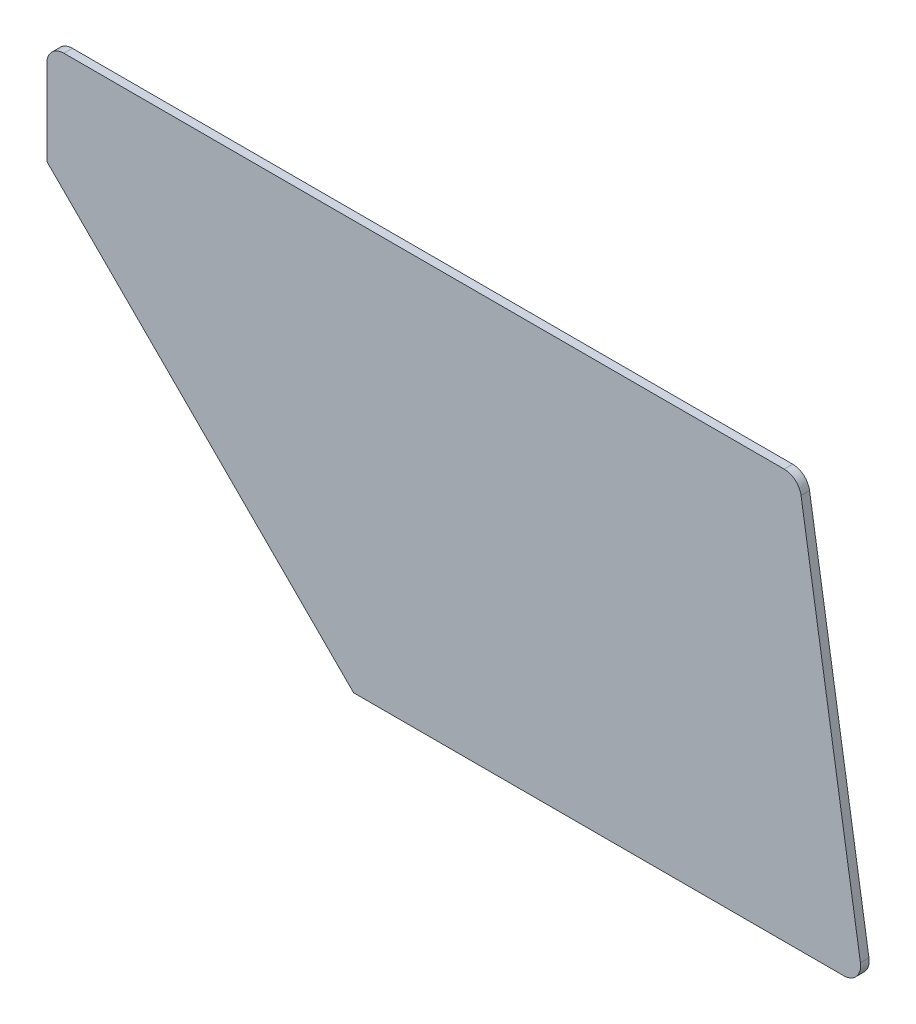
ISO-10303-21;
HEADER;
FILE_DESCRIPTION(('STEP AP214'),'2;1');
FILE_NAME('part.step','',(''),(''),'','','');
FILE_SCHEMA(('AUTOMOTIVE_DESIGN { 1 0 10303 214 1 1 1 1 }'));
ENDSEC;
DATA;
#1=APPLICATION_CONTEXT('core data for automotive mechanical design processes');
#2=APPLICATION_PROTOCOL_DEFINITION('international standard','automotive_design',2000,#1);
#3=PRODUCT_CONTEXT('',#1,'mechanical');
#4=PRODUCT('Part','Part','',(#3));
#5=PRODUCT_RELATED_PRODUCT_CATEGORY('part','',(#4));
#6=PRODUCT_DEFINITION_FORMATION('','',#4);
#7=PRODUCT_DEFINITION_CONTEXT('part definition',#1,'design');
#8=PRODUCT_DEFINITION('design','',#6,#7);
#9=PRODUCT_DEFINITION_SHAPE('','',#8);
#10=(LENGTH_UNIT() NAMED_UNIT(*) SI_UNIT(.MILLI.,.METRE.));
#11=(NAMED_UNIT(*) PLANE_ANGLE_UNIT() SI_UNIT($,.RADIAN.));
#12=(NAMED_UNIT(*) SI_UNIT($,.STERADIAN.) SOLID_ANGLE_UNIT());
#13=UNCERTAINTY_MEASURE_WITH_UNIT(LENGTH_MEASURE(1.E-05),#10,'distance_accuracy_value','');
#14=(GEOMETRIC_REPRESENTATION_CONTEXT(3) GLOBAL_UNCERTAINTY_ASSIGNED_CONTEXT((#13)) GLOBAL_UNIT_ASSIGNED_CONTEXT((#10,
#11,#12)) REPRESENTATION_CONTEXT('',''));
#15=CARTESIAN_POINT('',(0.,0.,0.));
#16=DIRECTION('',(0.,0.,1.));
#17=DIRECTION('',(1.,0.,0.));
#18=AXIS2_PLACEMENT_3D('',#15,#16,#17);
#19=CARTESIAN_POINT('',(0.,-38.1,3.175));
#20=DIRECTION('',(0.707106781186549,0.707106781186546,0.));
#21=DIRECTION('',(-0.707106781186546,0.707106781186549,0.));
#22=AXIS2_PLACEMENT_3D('',#19,#20,#21);
#23=PLANE('',#22);
#24=DIRECTION('',(0.707106781186546,-0.707106781186549,0.));
#25=VECTOR('',#24,1.);
#26=CARTESIAN_POINT('',(0.,-38.1,0.));
#27=LINE('',#26,#25);
#28=CARTESIAN_POINT('',(0.,-38.1,0.));
#29=VERTEX_POINT('',#28);
#30=CARTESIAN_POINT('',(114.3,-152.4,0.));
#31=VERTEX_POINT('',#30);
#32=EDGE_CURVE('E130',#29,#31,#27,.T.);
#33=ORIENTED_EDGE('',*,*,#32,.T.);
#34=DIRECTION('',(0.,0.,-1.));
#35=VECTOR('',#34,1.);
#36=CARTESIAN_POINT('',(114.3,-152.4,3.175));
#37=LINE('',#36,#35);
#38=CARTESIAN_POINT('',(114.3,-152.4,3.175));
#39=VERTEX_POINT('',#38);
#40=EDGE_CURVE('E11',#39,#31,#37,.T.);
#41=ORIENTED_EDGE('',*,*,#40,.F.);
#42=DIRECTION('',(0.707106781186546,-0.707106781186549,0.));
#43=VECTOR('',#42,1.);
#44=CARTESIAN_POINT('',(0.,-38.1,3.175));
#45=LINE('',#44,#43);
#46=CARTESIAN_POINT('',(0.,-38.1,3.175));
#47=VERTEX_POINT('',#46);
#48=EDGE_CURVE('E144',#47,#39,#45,.T.);
#49=ORIENTED_EDGE('',*,*,#48,.F.);
#50=DIRECTION('',(0.,0.,-1.));
#51=VECTOR('',#50,1.);
#52=CARTESIAN_POINT('',(0.,-38.1,3.175));
#53=LINE('',#52,#51);
#54=EDGE_CURVE('E126',#47,#29,#53,.T.);
#55=ORIENTED_EDGE('',*,*,#54,.T.);
#56=EDGE_LOOP('',(#33,#41,#49,#55));
#57=FACE_BOUND('',#56,.T.);
#58=ADVANCED_FACE('F34',(#57),#23,.F.);
#59=CARTESIAN_POINT('',(114.3,-152.4,3.175));
#60=DIRECTION('',(0.,1.,0.));
#61=DIRECTION('',(-1.,0.,0.));
#62=AXIS2_PLACEMENT_3D('',#59,#60,#61);
#63=PLANE('',#62);
#64=DIRECTION('',(1.,0.,0.));
#65=VECTOR('',#64,1.);
#66=CARTESIAN_POINT('',(114.3,-152.4,0.));
#67=LINE('',#66,#65);
#68=CARTESIAN_POINT('',(296.8625,-152.4,0.));
#69=VERTEX_POINT('',#68);
#70=EDGE_CURVE('E133',#31,#69,#67,.T.);
#71=ORIENTED_EDGE('',*,*,#70,.T.);
#72=DIRECTION('',(0.,0.,-1.));
#73=VECTOR('',#72,1.);
#74=CARTESIAN_POINT('',(296.8625,-152.4,3.175));
#75=LINE('',#74,#73);
#76=CARTESIAN_POINT('',(296.8625,-152.4,3.175));
#77=VERTEX_POINT('',#76);
#78=EDGE_CURVE('E42',#77,#69,#75,.T.);
#79=ORIENTED_EDGE('',*,*,#78,.F.);
#80=DIRECTION('',(1.,0.,0.));
#81=VECTOR('',#80,1.);
#82=CARTESIAN_POINT('',(114.3,-152.4,3.175));
#83=LINE('',#82,#81);
#84=EDGE_CURVE('E93',#39,#77,#83,.T.);
#85=ORIENTED_EDGE('',*,*,#84,.F.);
#86=ORIENTED_EDGE('',*,*,#40,.T.);
#87=EDGE_LOOP('',(#71,#79,#85,#86));
#88=FACE_BOUND('',#87,.T.);
#89=ADVANCED_FACE('F179',(#88),#63,.F.);
#90=CARTESIAN_POINT('',(296.8625,-146.05,3.175));
#91=DIRECTION('',(0.,0.,-1.));
#92=DIRECTION('',(-1.,0.,0.));
#93=AXIS2_PLACEMENT_3D('',#90,#91,#92);
#94=CYLINDRICAL_SURFACE('',#93,6.34999999999993);
#95=CARTESIAN_POINT('',(296.8625,-146.05,0.));
#96=DIRECTION('',(0.,0.,1.));
#97=DIRECTION('',(1.,0.,0.));
#98=AXIS2_PLACEMENT_3D('',#95,#96,#97);
#99=CIRCLE('',#98,6.34999999999993);
#100=CARTESIAN_POINT('',(303.134320962779,-145.056641146995,0.));
#101=VERTEX_POINT('',#100);
#102=EDGE_CURVE('E135',#69,#101,#99,.T.);
#103=ORIENTED_EDGE('',*,*,#102,.T.);
#104=DIRECTION('',(0.,0.,-1.));
#105=VECTOR('',#104,1.);
#106=CARTESIAN_POINT('',(303.134320962779,-145.056641146995,3.175));
#107=LINE('',#106,#105);
#108=CARTESIAN_POINT('',(303.134320962779,-145.056641146995,3.175));
#109=VERTEX_POINT('',#108);
#110=EDGE_CURVE('E151',#109,#101,#107,.T.);
#111=ORIENTED_EDGE('',*,*,#110,.F.);
#112=CARTESIAN_POINT('',(296.8625,-146.05,3.175));
#113=DIRECTION('',(0.,0.,1.));
#114=DIRECTION('',(1.,0.,0.));
#115=AXIS2_PLACEMENT_3D('',#112,#113,#114);
#116=CIRCLE('',#115,6.34999999999993);
#117=EDGE_CURVE('E159',#77,#109,#116,.T.);
#118=ORIENTED_EDGE('',*,*,#117,.F.);
#119=ORIENTED_EDGE('',*,*,#78,.T.);
#120=EDGE_LOOP('',(#103,#111,#118,#119));
#121=FACE_BOUND('',#120,.T.);
#122=ADVANCED_FACE('F157',(#121),#94,.T.);
#123=CARTESIAN_POINT('',(303.134320962779,-145.056641146995,3.175));
#124=DIRECTION('',(-0.987688340595137,-0.156434465040235,0.));
#125=DIRECTION('',(0.156434465040235,-0.987688340595137,0.));
#126=AXIS2_PLACEMENT_3D('',#123,#124,#125);
#127=PLANE('',#126);
#128=DIRECTION('',(-0.156434465040235,0.987688340595137,0.));
#129=VECTOR('',#128,1.);
#130=CARTESIAN_POINT('',(303.134320962779,-145.056641146995,0.));
#131=LINE('',#130,#129);
#132=CARTESIAN_POINT('',(281.008014649441,-5.35664114699449,0.));
#133=VERTEX_POINT('',#132);
#134=EDGE_CURVE('E137',#101,#133,#131,.T.);
#135=ORIENTED_EDGE('',*,*,#134,.T.);
#136=DIRECTION('',(0.,0.,-1.));
#137=VECTOR('',#136,1.);
#138=CARTESIAN_POINT('',(281.008014649441,-5.35664114699449,3.175));
#139=LINE('',#138,#137);
#140=CARTESIAN_POINT('',(281.008014649441,-5.35664114699449,3.175));
#141=VERTEX_POINT('',#140);
#142=EDGE_CURVE('E148',#141,#133,#139,.T.);
#143=ORIENTED_EDGE('',*,*,#142,.F.);
#144=DIRECTION('',(-0.156434465040235,0.987688340595137,0.));
#145=VECTOR('',#144,1.);
#146=CARTESIAN_POINT('',(303.134320962779,-145.056641146995,3.175));
#147=LINE('',#146,#145);
#148=EDGE_CURVE('E171',#109,#141,#147,.T.);
#149=ORIENTED_EDGE('',*,*,#148,.F.);
#150=ORIENTED_EDGE('',*,*,#110,.T.);
#151=EDGE_LOOP('',(#135,#143,#149,#150));
#152=FACE_BOUND('',#151,.T.);
#153=ADVANCED_FACE('F167',(#152),#127,.F.);
#154=CARTESIAN_POINT('',(274.736193686662,-6.34999999999997,3.175));
#155=DIRECTION('',(0.,0.,-1.));
#156=DIRECTION('',(-1.,0.,0.));
#157=AXIS2_PLACEMENT_3D('',#154,#155,#156);
#158=CYLINDRICAL_SURFACE('',#157,6.34999999999993);
#159=CARTESIAN_POINT('',(274.736193686662,-6.34999999999997,0.));
#160=DIRECTION('',(0.,0.,1.));
#161=DIRECTION('',(-1.,0.,0.));
#162=AXIS2_PLACEMENT_3D('',#159,#160,#161);
#163=CIRCLE('',#162,6.34999999999993);
#164=CARTESIAN_POINT('',(274.736193686662,0.,0.));
#165=VERTEX_POINT('',#164);
#166=EDGE_CURVE('E139',#133,#165,#163,.T.);
#167=ORIENTED_EDGE('',*,*,#166,.T.);
#168=DIRECTION('',(0.,0.,-1.));
#169=VECTOR('',#168,1.);
#170=CARTESIAN_POINT('',(274.736193686662,0.,3.175));
#171=LINE('',#170,#169);
#172=CARTESIAN_POINT('',(274.736193686662,0.,3.175));
#173=VERTEX_POINT('',#172);
#174=EDGE_CURVE('E121',#173,#165,#171,.T.);
#175=ORIENTED_EDGE('',*,*,#174,.F.);
#176=CARTESIAN_POINT('',(274.736193686662,-6.34999999999997,3.175));
#177=DIRECTION('',(0.,0.,1.));
#178=DIRECTION('',(-1.,0.,0.));
#179=AXIS2_PLACEMENT_3D('',#176,#177,#178);
#180=CIRCLE('',#179,6.34999999999993);
#181=EDGE_CURVE('E112',#141,#173,#180,.T.);
#182=ORIENTED_EDGE('',*,*,#181,.F.);
#183=ORIENTED_EDGE('',*,*,#142,.T.);
#184=EDGE_LOOP('',(#167,#175,#182,#183));
#185=FACE_BOUND('',#184,.T.);
#186=ADVANCED_FACE('F170',(#185),#158,.T.);
#187=CARTESIAN_POINT('',(274.736193686662,0.,3.175));
#188=DIRECTION('',(0.,-1.,0.));
#189=DIRECTION('',(1.,0.,0.));
#190=AXIS2_PLACEMENT_3D('',#187,#188,#189);
#191=PLANE('',#190);
#192=DIRECTION('',(-1.,0.,0.));
#193=VECTOR('',#192,1.);
#194=CARTESIAN_POINT('',(274.736193686662,0.,0.));
#195=LINE('',#194,#193);
#196=CARTESIAN_POINT('',(6.35000000000004,0.,0.));
#197=VERTEX_POINT('',#196);
#198=EDGE_CURVE('E120',#165,#197,#195,.T.);
#199=ORIENTED_EDGE('',*,*,#198,.T.);
#200=DIRECTION('',(0.,0.,-1.));
#201=VECTOR('',#200,1.);
#202=CARTESIAN_POINT('',(6.35000000000004,0.,3.175));
#203=LINE('',#202,#201);
#204=CARTESIAN_POINT('',(6.35000000000004,0.,3.175));
#205=VERTEX_POINT('',#204);
#206=EDGE_CURVE('E117',#205,#197,#203,.T.);
#207=ORIENTED_EDGE('',*,*,#206,.F.);
#208=DIRECTION('',(-1.,0.,0.));
#209=VECTOR('',#208,1.);
#210=CARTESIAN_POINT('',(274.736193686662,0.,3.175));
#211=LINE('',#210,#209);
#212=EDGE_CURVE('E106',#173,#205,#211,.T.);
#213=ORIENTED_EDGE('',*,*,#212,.F.);
#214=ORIENTED_EDGE('',*,*,#174,.T.);
#215=EDGE_LOOP('',(#199,#207,#213,#214));
#216=FACE_BOUND('',#215,.T.);
#217=ADVANCED_FACE('F118',(#216),#191,.F.);
#218=CARTESIAN_POINT('',(6.35,-6.35,3.175));
#219=DIRECTION('',(0.,0.,-1.));
#220=DIRECTION('',(-1.,0.,0.));
#221=AXIS2_PLACEMENT_3D('',#218,#219,#220);
#222=CYLINDRICAL_SURFACE('',#221,6.35);
#223=CARTESIAN_POINT('',(6.35,-6.35,0.));
#224=DIRECTION('',(0.,0.,1.));
#225=DIRECTION('',(1.,0.,0.));
#226=AXIS2_PLACEMENT_3D('',#223,#224,#225);
#227=CIRCLE('',#226,6.35);
#228=CARTESIAN_POINT('',(0.,-6.35000000000004,0.));
#229=VERTEX_POINT('',#228);
#230=EDGE_CURVE('E79',#197,#229,#227,.T.);
#231=ORIENTED_EDGE('',*,*,#230,.T.);
#232=DIRECTION('',(0.,0.,-1.));
#233=VECTOR('',#232,1.);
#234=CARTESIAN_POINT('',(0.,-6.35000000000004,3.175));
#235=LINE('',#234,#233);
#236=CARTESIAN_POINT('',(0.,-6.35000000000004,3.175));
#237=VERTEX_POINT('',#236);
#238=EDGE_CURVE('E122',#237,#229,#235,.T.);
#239=ORIENTED_EDGE('',*,*,#238,.F.);
#240=CARTESIAN_POINT('',(6.35,-6.35,3.175));
#241=DIRECTION('',(0.,0.,1.));
#242=DIRECTION('',(1.,0.,0.));
#243=AXIS2_PLACEMENT_3D('',#240,#241,#242);
#244=CIRCLE('',#243,6.35);
#245=EDGE_CURVE('E110',#205,#237,#244,.T.);
#246=ORIENTED_EDGE('',*,*,#245,.F.);
#247=ORIENTED_EDGE('',*,*,#206,.T.);
#248=EDGE_LOOP('',(#231,#239,#246,#247));
#249=FACE_BOUND('',#248,.T.);
#250=ADVANCED_FACE('F124',(#249),#222,.T.);
#251=CARTESIAN_POINT('',(0.,-6.35000000000004,3.175));
#252=DIRECTION('',(1.,0.,0.));
#253=DIRECTION('',(0.,0.,-1.));
#254=AXIS2_PLACEMENT_3D('',#251,#252,#253);
#255=PLANE('',#254);
#256=DIRECTION('',(0.,-1.,0.));
#257=VECTOR('',#256,1.);
#258=CARTESIAN_POINT('',(0.,-6.35000000000004,0.));
#259=LINE('',#258,#257);
#260=EDGE_CURVE('E85',#229,#29,#259,.T.);
#261=ORIENTED_EDGE('',*,*,#260,.T.);
#262=ORIENTED_EDGE('',*,*,#54,.F.);
#263=DIRECTION('',(0.,-1.,0.));
#264=VECTOR('',#263,1.);
#265=CARTESIAN_POINT('',(0.,-6.35000000000004,3.175));
#266=LINE('',#265,#264);
#267=EDGE_CURVE('E50',#237,#47,#266,.T.);
#268=ORIENTED_EDGE('',*,*,#267,.F.);
#269=ORIENTED_EDGE('',*,*,#238,.T.);
#270=EDGE_LOOP('',(#261,#262,#268,#269));
#271=FACE_BOUND('',#270,.T.);
#272=ADVANCED_FACE('F195',(#271),#255,.F.);
#273=CARTESIAN_POINT('',(296.8625,-146.05,3.175));
#274=DIRECTION('',(0.,0.,1.));
#275=DIRECTION('',(1.,0.,0.));
#276=AXIS2_PLACEMENT_3D('',#273,#274,#275);
#277=PLANE('',#276);
#278=ORIENTED_EDGE('',*,*,#48,.T.);
#279=ORIENTED_EDGE('',*,*,#84,.T.);
#280=ORIENTED_EDGE('',*,*,#117,.T.);
#281=ORIENTED_EDGE('',*,*,#148,.T.);
#282=ORIENTED_EDGE('',*,*,#181,.T.);
#283=ORIENTED_EDGE('',*,*,#212,.T.);
#284=ORIENTED_EDGE('',*,*,#245,.T.);
#285=ORIENTED_EDGE('',*,*,#267,.T.);
#286=EDGE_LOOP('',(#278,#279,#280,#281,#282,#283,#284,#285));
#287=FACE_BOUND('',#286,.T.);
#288=ADVANCED_FACE('F108',(#287),#277,.T.);
#289=CARTESIAN_POINT('',(296.8625,-146.05,0.));
#290=DIRECTION('',(0.,0.,1.));
#291=DIRECTION('',(1.,0.,0.));
#292=AXIS2_PLACEMENT_3D('',#289,#290,#291);
#293=PLANE('',#292);
#294=ORIENTED_EDGE('',*,*,#32,.F.);
#295=ORIENTED_EDGE('',*,*,#260,.F.);
#296=ORIENTED_EDGE('',*,*,#230,.F.);
#297=ORIENTED_EDGE('',*,*,#198,.F.);
#298=ORIENTED_EDGE('',*,*,#166,.F.);
#299=ORIENTED_EDGE('',*,*,#134,.F.);
#300=ORIENTED_EDGE('',*,*,#102,.F.);
#301=ORIENTED_EDGE('',*,*,#70,.F.);
#302=EDGE_LOOP('',(#294,#295,#296,#297,#298,#299,#300,#301));
#303=FACE_BOUND('',#302,.T.);
#304=ADVANCED_FACE('F163',(#303),#293,.F.);
#305=CLOSED_SHELL('',(#58,#89,#122,#153,#186,#217,#250,#272,#288,#304));
#306=MANIFOLD_SOLID_BREP('B2',#305);
#307=ADVANCED_BREP_SHAPE_REPRESENTATION('',(#18,#306),#14);
#308=SHAPE_DEFINITION_REPRESENTATION(#9,#307);
ENDSEC;
END-ISO-10303-21;
